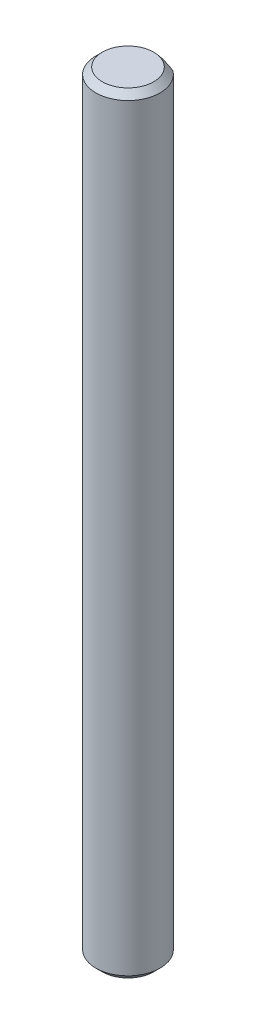
ISO-10303-21;
HEADER;
FILE_DESCRIPTION(('STEP AP214'),'2;1');
FILE_NAME('part.step','',(''),(''),'','','');
FILE_SCHEMA(('AUTOMOTIVE_DESIGN { 1 0 10303 214 1 1 1 1 }'));
ENDSEC;
DATA;
#1=APPLICATION_CONTEXT('core data for automotive mechanical design processes');
#2=APPLICATION_PROTOCOL_DEFINITION('international standard','automotive_design',2000,#1);
#3=PRODUCT_CONTEXT('',#1,'mechanical');
#4=PRODUCT('Part','Part','',(#3));
#5=PRODUCT_RELATED_PRODUCT_CATEGORY('part','',(#4));
#6=PRODUCT_DEFINITION_FORMATION('','',#4);
#7=PRODUCT_DEFINITION_CONTEXT('part definition',#1,'design');
#8=PRODUCT_DEFINITION('design','',#6,#7);
#9=PRODUCT_DEFINITION_SHAPE('','',#8);
#10=(LENGTH_UNIT() NAMED_UNIT(*) SI_UNIT(.MILLI.,.METRE.));
#11=(NAMED_UNIT(*) PLANE_ANGLE_UNIT() SI_UNIT($,.RADIAN.));
#12=(NAMED_UNIT(*) SI_UNIT($,.STERADIAN.) SOLID_ANGLE_UNIT());
#13=UNCERTAINTY_MEASURE_WITH_UNIT(LENGTH_MEASURE(1.E-05),#10,'distance_accuracy_value','');
#14=(GEOMETRIC_REPRESENTATION_CONTEXT(3) GLOBAL_UNCERTAINTY_ASSIGNED_CONTEXT((#13)) GLOBAL_UNIT_ASSIGNED_CONTEXT((#10,
#11,#12)) REPRESENTATION_CONTEXT('',''));
#15=CARTESIAN_POINT('',(0.,0.,0.));
#16=DIRECTION('',(0.,0.,1.));
#17=DIRECTION('',(1.,0.,0.));
#18=AXIS2_PLACEMENT_3D('',#15,#16,#17);
#19=CARTESIAN_POINT('',(0.,60.,0.));
#20=DIRECTION('',(0.,-1.,0.));
#21=DIRECTION('',(0.,0.,-1.));
#22=AXIS2_PLACEMENT_3D('',#19,#20,#21);
#23=CYLINDRICAL_SURFACE('',#22,2.5);
#24=CARTESIAN_POINT('',(0.,0.499999999999987,0.));
#25=DIRECTION('',(0.,1.,0.));
#26=DIRECTION('',(0.,0.,1.));
#27=AXIS2_PLACEMENT_3D('',#24,#25,#26);
#28=CIRCLE('',#27,2.5);
#29=CARTESIAN_POINT('',(0.,0.499999999999987,2.5));
#30=VERTEX_POINT('',#29);
#31=EDGE_CURVE('E100',#30,#30,#28,.T.);
#32=ORIENTED_EDGE('',*,*,#31,.T.);
#33=EDGE_LOOP('',(#32));
#34=FACE_BOUND('',#33,.T.);
#35=DIRECTION('',(0.,1.,0.));
#36=VECTOR('',#35,1.);
#37=CARTESIAN_POINT('',(1.5,45.,-2.));
#38=LINE('',#37,#36);
#39=CARTESIAN_POINT('',(1.5,45.,-2.));
#40=VERTEX_POINT('',#39);
#41=CARTESIAN_POINT('',(1.5,59.5,-2.));
#42=VERTEX_POINT('',#41);
#43=EDGE_CURVE('E88',#40,#42,#38,.T.);
#44=ORIENTED_EDGE('',*,*,#43,.T.);
#45=CARTESIAN_POINT('',(0.,59.5,0.));
#46=DIRECTION('',(0.,1.,0.));
#47=DIRECTION('',(0.,0.,1.));
#48=AXIS2_PLACEMENT_3D('',#45,#46,#47);
#49=CIRCLE('',#48,2.5);
#50=CARTESIAN_POINT('',(-1.5,59.5,-2.));
#51=VERTEX_POINT('',#50);
#52=EDGE_CURVE('E91',#42,#51,#49,.F.);
#53=ORIENTED_EDGE('',*,*,#52,.T.);
#54=DIRECTION('',(0.,1.,0.));
#55=VECTOR('',#54,1.);
#56=CARTESIAN_POINT('',(-1.5,45.,-2.));
#57=LINE('',#56,#55);
#58=CARTESIAN_POINT('',(-1.5,45.,-2.));
#59=VERTEX_POINT('',#58);
#60=EDGE_CURVE('E86',#59,#51,#57,.T.);
#61=ORIENTED_EDGE('',*,*,#60,.F.);
#62=CARTESIAN_POINT('',(0.,45.,0.));
#63=DIRECTION('',(0.,1.,0.));
#64=DIRECTION('',(0.,0.,1.));
#65=AXIS2_PLACEMENT_3D('',#62,#63,#64);
#66=CIRCLE('',#65,2.5);
#67=EDGE_CURVE('E76',#40,#59,#66,.T.);
#68=ORIENTED_EDGE('',*,*,#67,.F.);
#69=EDGE_LOOP('',(#44,#53,#61,#68));
#70=FACE_BOUND('',#69,.T.);
#71=ADVANCED_FACE('F40',(#34,#70),#23,.T.);
#72=CARTESIAN_POINT('',(0.,60.,0.));
#73=DIRECTION('',(0.,1.,0.));
#74=DIRECTION('',(0.,0.,1.));
#75=AXIS2_PLACEMENT_3D('',#72,#73,#74);
#76=PLANE('',#75);
#77=CARTESIAN_POINT('',(0.,60.,0.));
#78=DIRECTION('',(0.,1.,0.));
#79=DIRECTION('',(0.,0.,1.));
#80=AXIS2_PLACEMENT_3D('',#77,#78,#79);
#81=CIRCLE('',#80,1.99999999999999);
#82=CARTESIAN_POINT('',(0.,60.,-2.));
#83=VERTEX_POINT('',#82);
#84=EDGE_CURVE('E107',#83,#83,#81,.T.);
#85=ORIENTED_EDGE('',*,*,#84,.T.);
#86=EDGE_LOOP('',(#85));
#87=FACE_BOUND('',#86,.T.);
#88=ADVANCED_FACE('F120',(#87),#76,.T.);
#89=CARTESIAN_POINT('',(0.,0.,0.));
#90=DIRECTION('',(0.,1.,0.));
#91=DIRECTION('',(0.,0.,1.));
#92=AXIS2_PLACEMENT_3D('',#89,#90,#91);
#93=PLANE('',#92);
#94=CARTESIAN_POINT('',(0.,0.,0.));
#95=DIRECTION('',(0.,1.,0.));
#96=DIRECTION('',(0.,0.,1.));
#97=AXIS2_PLACEMENT_3D('',#94,#95,#96);
#98=CIRCLE('',#97,2.);
#99=CARTESIAN_POINT('',(0.,0.,2.));
#100=VERTEX_POINT('',#99);
#101=EDGE_CURVE('E103',#100,#100,#98,.F.);
#102=ORIENTED_EDGE('',*,*,#101,.T.);
#103=EDGE_LOOP('',(#102));
#104=FACE_BOUND('',#103,.T.);
#105=ADVANCED_FACE('F119',(#104),#93,.F.);
#106=CARTESIAN_POINT('',(-1.5,45.,-2.));
#107=DIRECTION('',(0.,0.,1.));
#108=DIRECTION('',(1.,0.,0.));
#109=AXIS2_PLACEMENT_3D('',#106,#107,#108);
#110=PLANE('',#109);
#111=CARTESIAN_POINT('',(-1.5,59.5,-2.));
#112=CARTESIAN_POINT('',(-1.42763018659214,59.5433736980276,-2.));
#113=CARTESIAN_POINT('',(-1.35436226532258,59.5853687019536,-2.));
#114=CARTESIAN_POINT('',(-1.20549660628809,59.6656443583189,-2.));
#115=CARTESIAN_POINT('',(-1.12989157710705,59.7039114197061,-2.));
#116=CARTESIAN_POINT('',(-0.978296734874828,59.774534191742,-2.));
#117=CARTESIAN_POINT('',(-0.902366736266405,59.8070165390548,-2.));
#118=CARTESIAN_POINT('',(-0.748220644904072,59.8658090166989,-2.));
#119=CARTESIAN_POINT('',(-0.670007876047703,59.8921276624893,-2.));
#120=CARTESIAN_POINT('',(-0.543060600019243,59.9280861032667,-2.));
#121=CARTESIAN_POINT('',(-0.495021163503641,59.9401901027996,-2.));
#122=CARTESIAN_POINT('',(-0.398260419217581,59.9612794306282,-2.));
#123=CARTESIAN_POINT('',(-0.349539198139853,59.9702651517484,-2.));
#124=CARTESIAN_POINT('',(-0.250852177401957,59.984927124024,-2.));
#125=CARTESIAN_POINT('',(-0.200878654038628,59.9905520018212,-2.));
#126=CARTESIAN_POINT('',(-0.10060761927617,59.9981023484678,-2.));
#127=CARTESIAN_POINT('',(-0.0503098472705247,60.0000243314446,-2.));
#128=CARTESIAN_POINT('',(0.,60.,-2.));
#129=B_SPLINE_CURVE_WITH_KNOTS('',3,(#111,#112,#113,#114,#115,#116,#117,#118,#119,#120,#121,
#122,#123,#124,#125,#126,#127,#128),.UNSPECIFIED.,.F.,.F.,(4,2,2,2,2,2,2,2,4),(0.,
0.2531950346956,0.507281075974288,0.754837752612877,1.00205037282502,1.15058504578388,
1.29910100031797,1.44983263801686,1.600706103947),.UNSPECIFIED.);
#130=EDGE_CURVE('E55',#51,#83,#129,.T.);
#131=ORIENTED_EDGE('',*,*,#130,.T.);
#132=CARTESIAN_POINT('',(0.,60.,-1.99999999999999));
#133=CARTESIAN_POINT('',(0.0614966481035619,60.0000514930087,-2.));
#134=CARTESIAN_POINT('',(0.122961796118779,59.997164788165,-2.));
#135=CARTESIAN_POINT('',(0.245274670057058,59.9859212389057,-2.));
#136=CARTESIAN_POINT('',(0.306123362775478,59.9775750221521,-2.));
#137=CARTESIAN_POINT('',(0.42588550990689,59.9559969816614,-2.));
#138=CARTESIAN_POINT('',(0.484814317272307,59.9428488248966,-2.));
#139=CARTESIAN_POINT('',(0.601555526074532,59.9122507618696,-2.));
#140=CARTESIAN_POINT('',(0.659367456410754,59.8947990813251,-2.));
#141=CARTESIAN_POINT('',(0.784576263433313,59.8525702057821,-2.));
#142=CARTESIAN_POINT('',(0.851714510760655,59.8270315815753,-2.));
#143=CARTESIAN_POINT('',(0.984250024576911,59.7717452055524,-2.));
#144=CARTESIAN_POINT('',(1.04964642506795,59.7419954048129,-2.));
#145=CARTESIAN_POINT('',(1.18016546542205,59.6784785026746,-2.));
#146=CARTESIAN_POINT('',(1.24525271545219,59.6446394298057,-2.));
#147=CARTESIAN_POINT('',(1.37378197006118,59.5742160914667,-2.));
#148=CARTESIAN_POINT('',(1.43722666174302,59.5376367483736,-2.));
#149=CARTESIAN_POINT('',(1.5,59.5,-2.));
#150=B_SPLINE_CURVE_WITH_KNOTS('',3,(#132,#133,#134,#135,#136,#137,#138,#139,#140,#141,#142,
#143,#144,#145,#146,#147,#148,#149),.UNSPECIFIED.,.F.,.F.,(4,2,2,2,2,2,2,2,4),(0.,
0.184371949240825,0.368386057907036,0.549336051664292,0.730360773654886,0.945674044871393,
1.16109243790835,1.38109142427278,1.60070428639641),.UNSPECIFIED.);
#151=EDGE_CURVE('E11',#83,#42,#150,.T.);
#152=ORIENTED_EDGE('',*,*,#151,.T.);
#153=ORIENTED_EDGE('',*,*,#43,.F.);
#154=DIRECTION('',(1.,0.,0.));
#155=VECTOR('',#154,1.);
#156=CARTESIAN_POINT('',(-1.5,45.,-2.));
#157=LINE('',#156,#155);
#158=EDGE_CURVE('E79',#59,#40,#157,.T.);
#159=ORIENTED_EDGE('',*,*,#158,.F.);
#160=ORIENTED_EDGE('',*,*,#60,.T.);
#161=EDGE_LOOP('',(#131,#152,#153,#159,#160));
#162=FACE_BOUND('',#161,.T.);
#163=ADVANCED_FACE('F85',(#162),#110,.F.);
#164=CARTESIAN_POINT('',(0.,45.,0.));
#165=DIRECTION('',(0.,1.,0.));
#166=DIRECTION('',(0.,0.,1.));
#167=AXIS2_PLACEMENT_3D('',#164,#165,#166);
#168=PLANE('',#167);
#169=ORIENTED_EDGE('',*,*,#67,.T.);
#170=ORIENTED_EDGE('',*,*,#158,.T.);
#171=EDGE_LOOP('',(#169,#170));
#172=FACE_BOUND('',#171,.T.);
#173=ADVANCED_FACE('F78',(#172),#168,.T.);
#174=CARTESIAN_POINT('',(0.,0.499999999999987,0.));
#175=DIRECTION('',(0.,1.,0.));
#176=DIRECTION('',(0.,0.,1.));
#177=AXIS2_PLACEMENT_3D('',#174,#175,#176);
#178=CONICAL_SURFACE('',#177,2.5,0.78539816339746);
#179=ORIENTED_EDGE('',*,*,#101,.F.);
#180=EDGE_LOOP('',(#179));
#181=FACE_BOUND('',#180,.T.);
#182=ORIENTED_EDGE('',*,*,#31,.F.);
#183=EDGE_LOOP('',(#182));
#184=FACE_BOUND('',#183,.T.);
#185=ADVANCED_FACE('F130',(#181,#184),#178,.T.);
#186=CARTESIAN_POINT('',(0.,60.,0.));
#187=DIRECTION('',(0.,-1.,0.));
#188=DIRECTION('',(0.,0.,-1.));
#189=AXIS2_PLACEMENT_3D('',#186,#187,#188);
#190=CONICAL_SURFACE('',#189,1.99999999999999,0.785398163397446);
#191=ORIENTED_EDGE('',*,*,#130,.F.);
#192=ORIENTED_EDGE('',*,*,#52,.F.);
#193=ORIENTED_EDGE('',*,*,#151,.F.);
#194=ORIENTED_EDGE('',*,*,#84,.F.);
#195=EDGE_LOOP('',(#191,#192,#193,#194));
#196=FACE_BOUND('',#195,.T.);
#197=ADVANCED_FACE('F42',(#196),#190,.T.);
#198=CLOSED_SHELL('',(#71,#88,#105,#163,#173,#185,#197));
#199=MANIFOLD_SOLID_BREP('B2',#198);
#200=ADVANCED_BREP_SHAPE_REPRESENTATION('',(#18,#199),#14);
#201=SHAPE_DEFINITION_REPRESENTATION(#9,#200);
ENDSEC;
END-ISO-10303-21;
